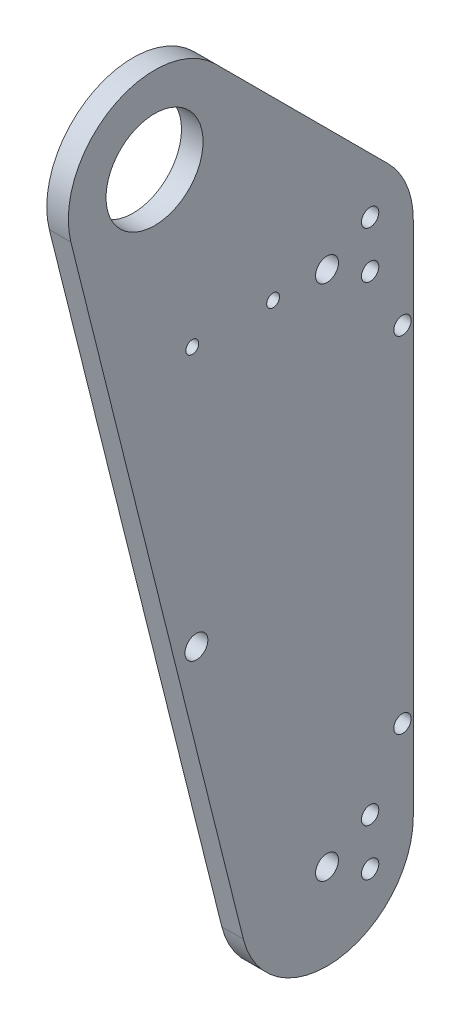
ISO-10303-21;
HEADER;
FILE_DESCRIPTION(('STEP AP214'),'2;1');
FILE_NAME('part.step','',(''),(''),'','','');
FILE_SCHEMA(('AUTOMOTIVE_DESIGN { 1 0 10303 214 1 1 1 1 }'));
ENDSEC;
DATA;
#1=APPLICATION_CONTEXT('core data for automotive mechanical design processes');
#2=APPLICATION_PROTOCOL_DEFINITION('international standard','automotive_design',2000,#1);
#3=PRODUCT_CONTEXT('',#1,'mechanical');
#4=PRODUCT('Part','Part','',(#3));
#5=PRODUCT_RELATED_PRODUCT_CATEGORY('part','',(#4));
#6=PRODUCT_DEFINITION_FORMATION('','',#4);
#7=PRODUCT_DEFINITION_CONTEXT('part definition',#1,'design');
#8=PRODUCT_DEFINITION('design','',#6,#7);
#9=PRODUCT_DEFINITION_SHAPE('','',#8);
#10=(LENGTH_UNIT() NAMED_UNIT(*) SI_UNIT(.MILLI.,.METRE.));
#11=(NAMED_UNIT(*) PLANE_ANGLE_UNIT() SI_UNIT($,.RADIAN.));
#12=(NAMED_UNIT(*) SI_UNIT($,.STERADIAN.) SOLID_ANGLE_UNIT());
#13=UNCERTAINTY_MEASURE_WITH_UNIT(LENGTH_MEASURE(1.E-05),#10,'distance_accuracy_value','');
#14=(GEOMETRIC_REPRESENTATION_CONTEXT(3) GLOBAL_UNCERTAINTY_ASSIGNED_CONTEXT((#13)) GLOBAL_UNIT_ASSIGNED_CONTEXT((#10,
#11,#12)) REPRESENTATION_CONTEXT('',''));
#15=CARTESIAN_POINT('',(0.,0.,0.));
#16=DIRECTION('',(0.,0.,1.));
#17=DIRECTION('',(1.,0.,0.));
#18=AXIS2_PLACEMENT_3D('',#15,#16,#17);
#19=CARTESIAN_POINT('',(6.35,0.,0.));
#20=DIRECTION('',(-1.,0.,0.));
#21=DIRECTION('',(0.,0.,1.));
#22=AXIS2_PLACEMENT_3D('',#19,#20,#21);
#23=CYLINDRICAL_SURFACE('',#22,25.4);
#24=CARTESIAN_POINT('',(0.,0.,0.));
#25=DIRECTION('',(1.,0.,0.));
#26=DIRECTION('',(0.,0.,-1.));
#27=AXIS2_PLACEMENT_3D('',#24,#25,#26);
#28=CIRCLE('',#27,25.4);
#29=CARTESIAN_POINT('',(0.,17.9605122421383,-17.9605122421383));
#30=VERTEX_POINT('',#29);
#31=CARTESIAN_POINT('',(0.,-6.16040487592286,24.6416195036914));
#32=VERTEX_POINT('',#31);
#33=EDGE_CURVE('E145',#30,#32,#28,.T.);
#34=ORIENTED_EDGE('',*,*,#33,.T.);
#35=DIRECTION('',(-1.,0.,0.));
#36=VECTOR('',#35,1.);
#37=CARTESIAN_POINT('',(6.35,-6.16040487592286,24.6416195036914));
#38=LINE('',#37,#36);
#39=CARTESIAN_POINT('',(6.35,-6.16040487592286,24.6416195036914));
#40=VERTEX_POINT('',#39);
#41=EDGE_CURVE('E11',#40,#32,#38,.T.);
#42=ORIENTED_EDGE('',*,*,#41,.F.);
#43=CARTESIAN_POINT('',(6.35,0.,0.));
#44=DIRECTION('',(1.,0.,0.));
#45=DIRECTION('',(0.,0.,-1.));
#46=AXIS2_PLACEMENT_3D('',#43,#44,#45);
#47=CIRCLE('',#46,25.4);
#48=CARTESIAN_POINT('',(6.35,17.9605122421383,-17.9605122421383));
#49=VERTEX_POINT('',#48);
#50=EDGE_CURVE('E162',#49,#40,#47,.T.);
#51=ORIENTED_EDGE('',*,*,#50,.F.);
#52=DIRECTION('',(-1.,0.,0.));
#53=VECTOR('',#52,1.);
#54=CARTESIAN_POINT('',(6.35,17.9605122421383,-17.9605122421383));
#55=LINE('',#54,#53);
#56=EDGE_CURVE('E141',#49,#30,#55,.T.);
#57=ORIENTED_EDGE('',*,*,#56,.T.);
#58=EDGE_LOOP('',(#34,#42,#51,#57));
#59=FACE_BOUND('',#58,.T.);
#60=ADVANCED_FACE('F43',(#59),#23,.T.);
#61=CARTESIAN_POINT('',(6.35,-6.16040487592286,24.6416195036914));
#62=DIRECTION('',(0.,0.242535625036333,-0.970142500145332));
#63=DIRECTION('',(0.,0.970142500145332,0.242535625036333));
#64=AXIS2_PLACEMENT_3D('',#61,#62,#63);
#65=PLANE('',#64);
#66=DIRECTION('',(0.,-0.970142500145332,-0.242535625036333));
#67=VECTOR('',#66,1.);
#68=CARTESIAN_POINT('',(0.,-6.16040487592286,24.6416195036914));
#69=LINE('',#68,#67);
#70=CARTESIAN_POINT('',(0.,-209.360404875923,-26.1583804963086));
#71=VERTEX_POINT('',#70);
#72=EDGE_CURVE('E149',#32,#71,#69,.T.);
#73=ORIENTED_EDGE('',*,*,#72,.T.);
#74=DIRECTION('',(-1.,0.,0.));
#75=VECTOR('',#74,1.);
#76=CARTESIAN_POINT('',(6.35,-209.360404875923,-26.1583804963086));
#77=LINE('',#76,#75);
#78=CARTESIAN_POINT('',(6.35,-209.360404875923,-26.1583804963086));
#79=VERTEX_POINT('',#78);
#80=EDGE_CURVE('E52',#79,#71,#77,.T.);
#81=ORIENTED_EDGE('',*,*,#80,.F.);
#82=DIRECTION('',(0.,-0.970142500145332,-0.242535625036333));
#83=VECTOR('',#82,1.);
#84=CARTESIAN_POINT('',(6.35,-6.16040487592286,24.6416195036914));
#85=LINE('',#84,#83);
#86=EDGE_CURVE('E106',#40,#79,#85,.T.);
#87=ORIENTED_EDGE('',*,*,#86,.F.);
#88=ORIENTED_EDGE('',*,*,#41,.T.);
#89=EDGE_LOOP('',(#73,#81,#87,#88));
#90=FACE_BOUND('',#89,.T.);
#91=ADVANCED_FACE('F191',(#90),#65,.F.);
#92=CARTESIAN_POINT('',(6.35,-203.2,-50.8));
#93=DIRECTION('',(-1.,0.,0.));
#94=DIRECTION('',(0.,0.,1.));
#95=AXIS2_PLACEMENT_3D('',#92,#93,#94);
#96=CYLINDRICAL_SURFACE('',#95,25.4);
#97=CARTESIAN_POINT('',(0.,-203.2,-50.8));
#98=DIRECTION('',(1.,0.,0.));
#99=DIRECTION('',(0.,0.,-1.));
#100=AXIS2_PLACEMENT_3D('',#97,#98,#99);
#101=CIRCLE('',#100,25.4);
#102=CARTESIAN_POINT('',(0.,-203.2,-76.2));
#103=VERTEX_POINT('',#102);
#104=EDGE_CURVE('E153',#71,#103,#101,.T.);
#105=ORIENTED_EDGE('',*,*,#104,.T.);
#106=DIRECTION('',(-1.,0.,0.));
#107=VECTOR('',#106,1.);
#108=CARTESIAN_POINT('',(6.35,-203.2,-76.2));
#109=LINE('',#108,#107);
#110=CARTESIAN_POINT('',(6.35,-203.2,-76.2));
#111=VERTEX_POINT('',#110);
#112=EDGE_CURVE('E133',#111,#103,#109,.T.);
#113=ORIENTED_EDGE('',*,*,#112,.F.);
#114=CARTESIAN_POINT('',(6.35,-203.2,-50.8));
#115=DIRECTION('',(1.,0.,0.));
#116=DIRECTION('',(0.,0.,-1.));
#117=AXIS2_PLACEMENT_3D('',#114,#115,#116);
#118=CIRCLE('',#117,25.4);
#119=EDGE_CURVE('E122',#79,#111,#118,.T.);
#120=ORIENTED_EDGE('',*,*,#119,.F.);
#121=ORIENTED_EDGE('',*,*,#80,.T.);
#122=EDGE_LOOP('',(#105,#113,#120,#121));
#123=FACE_BOUND('',#122,.T.);
#124=ADVANCED_FACE('F172',(#123),#96,.T.);
#125=CARTESIAN_POINT('',(6.35,-203.2,-76.2));
#126=DIRECTION('',(0.,0.,1.));
#127=DIRECTION('',(1.,0.,0.));
#128=AXIS2_PLACEMENT_3D('',#125,#126,#127);
#129=PLANE('',#128);
#130=DIRECTION('',(0.,1.,0.));
#131=VECTOR('',#130,1.);
#132=CARTESIAN_POINT('',(0.,-203.2,-76.2));
#133=LINE('',#132,#131);
#134=CARTESIAN_POINT('',(0.,-50.8,-76.2));
#135=VERTEX_POINT('',#134);
#136=EDGE_CURVE('E131',#103,#135,#133,.T.);
#137=ORIENTED_EDGE('',*,*,#136,.T.);
#138=DIRECTION('',(-1.,0.,0.));
#139=VECTOR('',#138,1.);
#140=CARTESIAN_POINT('',(6.35,-50.8,-76.2));
#141=LINE('',#140,#139);
#142=CARTESIAN_POINT('',(6.35,-50.8,-76.2));
#143=VERTEX_POINT('',#142);
#144=EDGE_CURVE('E128',#143,#135,#141,.T.);
#145=ORIENTED_EDGE('',*,*,#144,.F.);
#146=DIRECTION('',(0.,1.,0.));
#147=VECTOR('',#146,1.);
#148=CARTESIAN_POINT('',(6.35,-203.2,-76.2));
#149=LINE('',#148,#147);
#150=EDGE_CURVE('E116',#111,#143,#149,.T.);
#151=ORIENTED_EDGE('',*,*,#150,.F.);
#152=ORIENTED_EDGE('',*,*,#112,.T.);
#153=EDGE_LOOP('',(#137,#145,#151,#152));
#154=FACE_BOUND('',#153,.T.);
#155=ADVANCED_FACE('F129',(#154),#129,.F.);
#156=CARTESIAN_POINT('',(6.35,-50.8,-50.8));
#157=DIRECTION('',(-1.,0.,0.));
#158=DIRECTION('',(0.,0.,1.));
#159=AXIS2_PLACEMENT_3D('',#156,#157,#158);
#160=CYLINDRICAL_SURFACE('',#159,25.4);
#161=CARTESIAN_POINT('',(0.,-50.8,-50.8));
#162=DIRECTION('',(1.,0.,0.));
#163=DIRECTION('',(0.,0.,-1.));
#164=AXIS2_PLACEMENT_3D('',#161,#162,#163);
#165=CIRCLE('',#164,25.4);
#166=CARTESIAN_POINT('',(0.,-32.8394877578617,-68.7605122421383));
#167=VERTEX_POINT('',#166);
#168=EDGE_CURVE('E92',#135,#167,#165,.T.);
#169=ORIENTED_EDGE('',*,*,#168,.T.);
#170=DIRECTION('',(-1.,0.,0.));
#171=VECTOR('',#170,1.);
#172=CARTESIAN_POINT('',(6.35,-32.8394877578617,-68.7605122421383));
#173=LINE('',#172,#171);
#174=CARTESIAN_POINT('',(6.35,-32.8394877578617,-68.7605122421383));
#175=VERTEX_POINT('',#174);
#176=EDGE_CURVE('E134',#175,#167,#173,.T.);
#177=ORIENTED_EDGE('',*,*,#176,.F.);
#178=CARTESIAN_POINT('',(6.35,-50.8,-50.8));
#179=DIRECTION('',(1.,0.,0.));
#180=DIRECTION('',(0.,0.,-1.));
#181=AXIS2_PLACEMENT_3D('',#178,#179,#180);
#182=CIRCLE('',#181,25.4);
#183=EDGE_CURVE('E120',#143,#175,#182,.T.);
#184=ORIENTED_EDGE('',*,*,#183,.F.);
#185=ORIENTED_EDGE('',*,*,#144,.T.);
#186=EDGE_LOOP('',(#169,#177,#184,#185));
#187=FACE_BOUND('',#186,.T.);
#188=ADVANCED_FACE('F136',(#187),#160,.T.);
#189=CARTESIAN_POINT('',(6.35,-32.8394877578617,-68.7605122421383));
#190=DIRECTION('',(0.,-0.707106781186548,0.707106781186547));
#191=DIRECTION('',(0.,-0.707106781186547,-0.707106781186548));
#192=AXIS2_PLACEMENT_3D('',#189,#190,#191);
#193=PLANE('',#192);
#194=DIRECTION('',(0.,0.707106781186547,0.707106781186548));
#195=VECTOR('',#194,1.);
#196=CARTESIAN_POINT('',(0.,-32.8394877578617,-68.7605122421383));
#197=LINE('',#196,#195);
#198=EDGE_CURVE('E98',#167,#30,#197,.T.);
#199=ORIENTED_EDGE('',*,*,#198,.T.);
#200=ORIENTED_EDGE('',*,*,#56,.F.);
#201=DIRECTION('',(0.,0.707106781186547,0.707106781186548));
#202=VECTOR('',#201,1.);
#203=CARTESIAN_POINT('',(6.35,-32.8394877578617,-68.7605122421383));
#204=LINE('',#203,#202);
#205=EDGE_CURVE('E63',#175,#49,#204,.T.);
#206=ORIENTED_EDGE('',*,*,#205,.F.);
#207=ORIENTED_EDGE('',*,*,#176,.T.);
#208=EDGE_LOOP('',(#199,#200,#206,#207));
#209=FACE_BOUND('',#208,.T.);
#210=ADVANCED_FACE('F179',(#209),#193,.F.);
#211=CARTESIAN_POINT('',(6.35,0.,0.));
#212=DIRECTION('',(1.,0.,0.));
#213=DIRECTION('',(0.,0.,-1.));
#214=AXIS2_PLACEMENT_3D('',#211,#212,#213);
#215=PLANE('',#214);
#216=CARTESIAN_POINT('',(6.35,-76.2,-73.025));
#217=DIRECTION('',(-1.,0.,0.));
#218=DIRECTION('',(0.,0.,1.));
#219=AXIS2_PLACEMENT_3D('',#216,#217,#218);
#220=CIRCLE('',#219,2.55270000000001);
#221=CARTESIAN_POINT('',(6.35,-76.2,-70.4723));
#222=VERTEX_POINT('',#221);
#223=EDGE_CURVE('E366',#222,#222,#220,.T.);
#224=ORIENTED_EDGE('',*,*,#223,.T.);
#225=EDGE_LOOP('',(#224));
#226=FACE_BOUND('',#225,.T.);
#227=CARTESIAN_POINT('',(6.35,-177.8,-73.025));
#228=DIRECTION('',(-1.,0.,0.));
#229=DIRECTION('',(0.,0.,1.));
#230=AXIS2_PLACEMENT_3D('',#227,#228,#229);
#231=CIRCLE('',#230,2.55269999999999);
#232=CARTESIAN_POINT('',(6.35,-177.8,-70.4723));
#233=VERTEX_POINT('',#232);
#234=EDGE_CURVE('E379',#233,#233,#231,.T.);
#235=ORIENTED_EDGE('',*,*,#234,.T.);
#236=EDGE_LOOP('',(#235));
#237=FACE_BOUND('',#236,.T.);
#238=CARTESIAN_POINT('',(6.35,-50.8,-34.925));
#239=DIRECTION('',(-1.,0.,0.));
#240=DIRECTION('',(0.,0.,1.));
#241=AXIS2_PLACEMENT_3D('',#238,#239,#240);
#242=CIRCLE('',#241,1.89864999999999);
#243=CARTESIAN_POINT('',(6.35,-50.8,-33.02635));
#244=VERTEX_POINT('',#243);
#245=EDGE_CURVE('E387',#244,#244,#242,.T.);
#246=ORIENTED_EDGE('',*,*,#245,.T.);
#247=EDGE_LOOP('',(#246));
#248=FACE_BOUND('',#247,.T.);
#249=CARTESIAN_POINT('',(6.35,-50.8,-11.1125));
#250=DIRECTION('',(-1.,0.,0.));
#251=DIRECTION('',(0.,0.,1.));
#252=AXIS2_PLACEMENT_3D('',#249,#250,#251);
#253=CIRCLE('',#252,1.89864999999999);
#254=CARTESIAN_POINT('',(6.35,-50.8,-9.21385000000004));
#255=VERTEX_POINT('',#254);
#256=EDGE_CURVE('E395',#255,#255,#253,.T.);
#257=ORIENTED_EDGE('',*,*,#256,.T.);
#258=EDGE_LOOP('',(#257));
#259=FACE_BOUND('',#258,.T.);
#260=CARTESIAN_POINT('',(6.35,-57.7088,-63.5));
#261=DIRECTION('',(-1.,0.,0.));
#262=DIRECTION('',(0.,0.,1.));
#263=AXIS2_PLACEMENT_3D('',#260,#261,#262);
#264=CIRCLE('',#263,2.5527);
#265=CARTESIAN_POINT('',(6.35,-57.7088,-60.9473));
#266=VERTEX_POINT('',#265);
#267=EDGE_CURVE('E402',#266,#266,#264,.T.);
#268=ORIENTED_EDGE('',*,*,#267,.T.);
#269=EDGE_LOOP('',(#268));
#270=FACE_BOUND('',#269,.T.);
#271=CARTESIAN_POINT('',(6.35,-43.8912,-63.5));
#272=DIRECTION('',(-1.,0.,0.));
#273=DIRECTION('',(0.,0.,1.));
#274=AXIS2_PLACEMENT_3D('',#271,#272,#273);
#275=CIRCLE('',#274,2.5527);
#276=CARTESIAN_POINT('',(6.35,-43.8912,-60.9473));
#277=VERTEX_POINT('',#276);
#278=EDGE_CURVE('E410',#277,#277,#275,.T.);
#279=ORIENTED_EDGE('',*,*,#278,.T.);
#280=EDGE_LOOP('',(#279));
#281=FACE_BOUND('',#280,.T.);
#282=CARTESIAN_POINT('',(6.35,-196.2912,-63.5));
#283=DIRECTION('',(-1.,0.,0.));
#284=DIRECTION('',(0.,0.,1.));
#285=AXIS2_PLACEMENT_3D('',#282,#283,#284);
#286=CIRCLE('',#285,2.55269999999999);
#287=CARTESIAN_POINT('',(6.35,-196.2912,-60.9473));
#288=VERTEX_POINT('',#287);
#289=EDGE_CURVE('E418',#288,#288,#286,.T.);
#290=ORIENTED_EDGE('',*,*,#289,.T.);
#291=EDGE_LOOP('',(#290));
#292=FACE_BOUND('',#291,.T.);
#293=CARTESIAN_POINT('',(6.35,-210.1088,-63.5));
#294=DIRECTION('',(-1.,0.,0.));
#295=DIRECTION('',(0.,0.,1.));
#296=AXIS2_PLACEMENT_3D('',#293,#294,#295);
#297=CIRCLE('',#296,2.55269999999999);
#298=CARTESIAN_POINT('',(6.35,-210.1088,-60.9473));
#299=VERTEX_POINT('',#298);
#300=EDGE_CURVE('E426',#299,#299,#297,.T.);
#301=ORIENTED_EDGE('',*,*,#300,.T.);
#302=EDGE_LOOP('',(#301));
#303=FACE_BOUND('',#302,.T.);
#304=CARTESIAN_POINT('',(6.35,-50.8,-50.8));
#305=DIRECTION('',(1.,0.,0.));
#306=DIRECTION('',(0.,0.,-1.));
#307=AXIS2_PLACEMENT_3D('',#304,#305,#306);
#308=CIRCLE('',#307,3.37819999999998);
#309=CARTESIAN_POINT('',(6.35,-50.8,-54.1782));
#310=VERTEX_POINT('',#309);
#311=EDGE_CURVE('E430',#310,#310,#308,.T.);
#312=ORIENTED_EDGE('',*,*,#311,.F.);
#313=EDGE_LOOP('',(#312));
#314=FACE_BOUND('',#313,.T.);
#315=CARTESIAN_POINT('',(6.35,-203.2,-50.8));
#316=DIRECTION('',(1.,0.,0.));
#317=DIRECTION('',(0.,0.,-1.));
#318=AXIS2_PLACEMENT_3D('',#315,#316,#317);
#319=CIRCLE('',#318,3.3782);
#320=CARTESIAN_POINT('',(6.35,-203.2,-54.1782));
#321=VERTEX_POINT('',#320);
#322=EDGE_CURVE('E438',#321,#321,#319,.T.);
#323=ORIENTED_EDGE('',*,*,#322,.F.);
#324=EDGE_LOOP('',(#323));
#325=FACE_BOUND('',#324,.T.);
#326=CARTESIAN_POINT('',(6.35,-127.828401175399,-12.3208097518457));
#327=DIRECTION('',(1.,0.,0.));
#328=DIRECTION('',(0.,0.,-1.));
#329=AXIS2_PLACEMENT_3D('',#326,#327,#328);
#330=CIRCLE('',#329,3.37819999999998);
#331=CARTESIAN_POINT('',(6.35,-127.828401175399,-15.6990097518457));
#332=VERTEX_POINT('',#331);
#333=EDGE_CURVE('E446',#332,#332,#330,.T.);
#334=ORIENTED_EDGE('',*,*,#333,.F.);
#335=EDGE_LOOP('',(#334));
#336=FACE_BOUND('',#335,.T.);
#337=CARTESIAN_POINT('',(6.35,0.,0.));
#338=DIRECTION('',(1.,0.,0.));
#339=DIRECTION('',(0.,0.,-1.));
#340=AXIS2_PLACEMENT_3D('',#337,#338,#339);
#341=CIRCLE('',#340,14.2875);
#342=CARTESIAN_POINT('',(6.35,0.,-14.2875));
#343=VERTEX_POINT('',#342);
#344=EDGE_CURVE('E454',#343,#343,#341,.T.);
#345=ORIENTED_EDGE('',*,*,#344,.F.);
#346=EDGE_LOOP('',(#345));
#347=FACE_BOUND('',#346,.T.);
#348=ORIENTED_EDGE('',*,*,#50,.T.);
#349=ORIENTED_EDGE('',*,*,#86,.T.);
#350=ORIENTED_EDGE('',*,*,#119,.T.);
#351=ORIENTED_EDGE('',*,*,#150,.T.);
#352=ORIENTED_EDGE('',*,*,#183,.T.);
#353=ORIENTED_EDGE('',*,*,#205,.T.);
#354=EDGE_LOOP('',(#348,#349,#350,#351,#352,#353));
#355=FACE_BOUND('',#354,.T.);
#356=ADVANCED_FACE('F118',(#226,#237,#248,#259,#270,#281,#292,#303,#314,#325,#336,#347,#355),
#215,.T.);
#357=CARTESIAN_POINT('',(0.,0.,0.));
#358=DIRECTION('',(1.,0.,0.));
#359=DIRECTION('',(0.,0.,-1.));
#360=AXIS2_PLACEMENT_3D('',#357,#358,#359);
#361=PLANE('',#360);
#362=CARTESIAN_POINT('',(0.,-76.2,-73.025));
#363=DIRECTION('',(-1.,0.,0.));
#364=DIRECTION('',(0.,0.,1.));
#365=AXIS2_PLACEMENT_3D('',#362,#363,#364);
#366=CIRCLE('',#365,2.55270000000001);
#367=CARTESIAN_POINT('',(0.,-76.2,-70.4723));
#368=VERTEX_POINT('',#367);
#369=EDGE_CURVE('E369',#368,#368,#366,.T.);
#370=ORIENTED_EDGE('',*,*,#369,.F.);
#371=EDGE_LOOP('',(#370));
#372=FACE_BOUND('',#371,.T.);
#373=CARTESIAN_POINT('',(0.,-177.8,-73.025));
#374=DIRECTION('',(-1.,0.,0.));
#375=DIRECTION('',(0.,0.,1.));
#376=AXIS2_PLACEMENT_3D('',#373,#374,#375);
#377=CIRCLE('',#376,2.55269999999999);
#378=CARTESIAN_POINT('',(0.,-177.8,-70.4723));
#379=VERTEX_POINT('',#378);
#380=EDGE_CURVE('E373',#379,#379,#377,.T.);
#381=ORIENTED_EDGE('',*,*,#380,.F.);
#382=EDGE_LOOP('',(#381));
#383=FACE_BOUND('',#382,.T.);
#384=CARTESIAN_POINT('',(0.,-50.8,-34.925));
#385=DIRECTION('',(-1.,0.,0.));
#386=DIRECTION('',(0.,0.,1.));
#387=AXIS2_PLACEMENT_3D('',#384,#385,#386);
#388=CIRCLE('',#387,1.89864999999999);
#389=CARTESIAN_POINT('',(0.,-50.8,-33.02635));
#390=VERTEX_POINT('',#389);
#391=EDGE_CURVE('E383',#390,#390,#388,.T.);
#392=ORIENTED_EDGE('',*,*,#391,.F.);
#393=EDGE_LOOP('',(#392));
#394=FACE_BOUND('',#393,.T.);
#395=CARTESIAN_POINT('',(0.,-50.8,-11.1125));
#396=DIRECTION('',(-1.,0.,0.));
#397=DIRECTION('',(0.,0.,1.));
#398=AXIS2_PLACEMENT_3D('',#395,#396,#397);
#399=CIRCLE('',#398,1.89864999999999);
#400=CARTESIAN_POINT('',(0.,-50.8,-9.21385000000003));
#401=VERTEX_POINT('',#400);
#402=EDGE_CURVE('E391',#401,#401,#399,.T.);
#403=ORIENTED_EDGE('',*,*,#402,.F.);
#404=EDGE_LOOP('',(#403));
#405=FACE_BOUND('',#404,.T.);
#406=CARTESIAN_POINT('',(0.,-57.7088,-63.5));
#407=DIRECTION('',(-1.,0.,0.));
#408=DIRECTION('',(0.,0.,1.));
#409=AXIS2_PLACEMENT_3D('',#406,#407,#408);
#410=CIRCLE('',#409,2.5527);
#411=CARTESIAN_POINT('',(0.,-57.7088,-60.9473));
#412=VERTEX_POINT('',#411);
#413=EDGE_CURVE('E399',#412,#412,#410,.T.);
#414=ORIENTED_EDGE('',*,*,#413,.F.);
#415=EDGE_LOOP('',(#414));
#416=FACE_BOUND('',#415,.T.);
#417=CARTESIAN_POINT('',(0.,-43.8912,-63.5));
#418=DIRECTION('',(-1.,0.,0.));
#419=DIRECTION('',(0.,0.,1.));
#420=AXIS2_PLACEMENT_3D('',#417,#418,#419);
#421=CIRCLE('',#420,2.5527);
#422=CARTESIAN_POINT('',(0.,-43.8912,-60.9473));
#423=VERTEX_POINT('',#422);
#424=EDGE_CURVE('E406',#423,#423,#421,.T.);
#425=ORIENTED_EDGE('',*,*,#424,.F.);
#426=EDGE_LOOP('',(#425));
#427=FACE_BOUND('',#426,.T.);
#428=CARTESIAN_POINT('',(0.,-196.2912,-63.5));
#429=DIRECTION('',(-1.,0.,0.));
#430=DIRECTION('',(0.,0.,1.));
#431=AXIS2_PLACEMENT_3D('',#428,#429,#430);
#432=CIRCLE('',#431,2.55269999999999);
#433=CARTESIAN_POINT('',(0.,-196.2912,-60.9473));
#434=VERTEX_POINT('',#433);
#435=EDGE_CURVE('E414',#434,#434,#432,.T.);
#436=ORIENTED_EDGE('',*,*,#435,.F.);
#437=EDGE_LOOP('',(#436));
#438=FACE_BOUND('',#437,.T.);
#439=CARTESIAN_POINT('',(0.,-210.1088,-63.5));
#440=DIRECTION('',(-1.,0.,0.));
#441=DIRECTION('',(0.,0.,1.));
#442=AXIS2_PLACEMENT_3D('',#439,#440,#441);
#443=CIRCLE('',#442,2.55269999999999);
#444=CARTESIAN_POINT('',(0.,-210.1088,-60.9473));
#445=VERTEX_POINT('',#444);
#446=EDGE_CURVE('E422',#445,#445,#443,.T.);
#447=ORIENTED_EDGE('',*,*,#446,.F.);
#448=EDGE_LOOP('',(#447));
#449=FACE_BOUND('',#448,.T.);
#450=CARTESIAN_POINT('',(0.,-50.8,-50.8));
#451=DIRECTION('',(1.,0.,0.));
#452=DIRECTION('',(0.,0.,-1.));
#453=AXIS2_PLACEMENT_3D('',#450,#451,#452);
#454=CIRCLE('',#453,3.3782);
#455=CARTESIAN_POINT('',(0.,-50.8,-54.1782));
#456=VERTEX_POINT('',#455);
#457=EDGE_CURVE('E434',#456,#456,#454,.T.);
#458=ORIENTED_EDGE('',*,*,#457,.T.);
#459=EDGE_LOOP('',(#458));
#460=FACE_BOUND('',#459,.T.);
#461=CARTESIAN_POINT('',(0.,-203.2,-50.8));
#462=DIRECTION('',(1.,0.,0.));
#463=DIRECTION('',(0.,0.,-1.));
#464=AXIS2_PLACEMENT_3D('',#461,#462,#463);
#465=CIRCLE('',#464,3.3782);
#466=CARTESIAN_POINT('',(0.,-203.2,-54.1782));
#467=VERTEX_POINT('',#466);
#468=EDGE_CURVE('E442',#467,#467,#465,.T.);
#469=ORIENTED_EDGE('',*,*,#468,.T.);
#470=EDGE_LOOP('',(#469));
#471=FACE_BOUND('',#470,.T.);
#472=CARTESIAN_POINT('',(0.,-127.828401175399,-12.3208097518457));
#473=DIRECTION('',(1.,0.,0.));
#474=DIRECTION('',(0.,0.,-1.));
#475=AXIS2_PLACEMENT_3D('',#472,#473,#474);
#476=CIRCLE('',#475,3.3782);
#477=CARTESIAN_POINT('',(0.,-127.828401175399,-15.6990097518457));
#478=VERTEX_POINT('',#477);
#479=EDGE_CURVE('E450',#478,#478,#476,.T.);
#480=ORIENTED_EDGE('',*,*,#479,.T.);
#481=EDGE_LOOP('',(#480));
#482=FACE_BOUND('',#481,.T.);
#483=CARTESIAN_POINT('',(0.,0.,0.));
#484=DIRECTION('',(1.,0.,0.));
#485=DIRECTION('',(0.,0.,-1.));
#486=AXIS2_PLACEMENT_3D('',#483,#484,#485);
#487=CIRCLE('',#486,14.2875);
#488=CARTESIAN_POINT('',(0.,0.,-14.2875));
#489=VERTEX_POINT('',#488);
#490=EDGE_CURVE('E150',#489,#489,#487,.T.);
#491=ORIENTED_EDGE('',*,*,#490,.T.);
#492=EDGE_LOOP('',(#491));
#493=FACE_BOUND('',#492,.T.);
#494=ORIENTED_EDGE('',*,*,#33,.F.);
#495=ORIENTED_EDGE('',*,*,#198,.F.);
#496=ORIENTED_EDGE('',*,*,#168,.F.);
#497=ORIENTED_EDGE('',*,*,#136,.F.);
#498=ORIENTED_EDGE('',*,*,#104,.F.);
#499=ORIENTED_EDGE('',*,*,#72,.F.);
#500=EDGE_LOOP('',(#494,#495,#496,#497,#498,#499));
#501=FACE_BOUND('',#500,.T.);
#502=ADVANCED_FACE('F175',(#372,#383,#394,#405,#416,#427,#438,#449,#460,#471,#482,#493,#501),
#361,.F.);
#503=CARTESIAN_POINT('',(6.35,0.,0.));
#504=DIRECTION('',(1.,0.,0.));
#505=DIRECTION('',(0.,0.,-1.));
#506=AXIS2_PLACEMENT_3D('',#503,#504,#505);
#507=CYLINDRICAL_SURFACE('',#506,14.2875);
#508=ORIENTED_EDGE('',*,*,#490,.F.);
#509=EDGE_LOOP('',(#508));
#510=FACE_BOUND('',#509,.T.);
#511=ORIENTED_EDGE('',*,*,#344,.T.);
#512=EDGE_LOOP('',(#511));
#513=FACE_BOUND('',#512,.T.);
#514=ADVANCED_FACE('F224',(#510,#513),#507,.F.);
#515=CARTESIAN_POINT('',(6.35,-127.828401175399,-12.3208097518457));
#516=DIRECTION('',(1.,0.,0.));
#517=DIRECTION('',(0.,0.,-1.));
#518=AXIS2_PLACEMENT_3D('',#515,#516,#517);
#519=CYLINDRICAL_SURFACE('',#518,3.37819999999999);
#520=ORIENTED_EDGE('',*,*,#479,.F.);
#521=EDGE_LOOP('',(#520));
#522=FACE_BOUND('',#521,.T.);
#523=ORIENTED_EDGE('',*,*,#333,.T.);
#524=EDGE_LOOP('',(#523));
#525=FACE_BOUND('',#524,.T.);
#526=ADVANCED_FACE('F230',(#522,#525),#519,.F.);
#527=CARTESIAN_POINT('',(6.35,-203.2,-50.8));
#528=DIRECTION('',(1.,0.,0.));
#529=DIRECTION('',(0.,0.,-1.));
#530=AXIS2_PLACEMENT_3D('',#527,#528,#529);
#531=CYLINDRICAL_SURFACE('',#530,3.3782);
#532=ORIENTED_EDGE('',*,*,#468,.F.);
#533=EDGE_LOOP('',(#532));
#534=FACE_BOUND('',#533,.T.);
#535=ORIENTED_EDGE('',*,*,#322,.T.);
#536=EDGE_LOOP('',(#535));
#537=FACE_BOUND('',#536,.T.);
#538=ADVANCED_FACE('F242',(#534,#537),#531,.F.);
#539=CARTESIAN_POINT('',(6.35,-50.8,-50.8));
#540=DIRECTION('',(1.,0.,0.));
#541=DIRECTION('',(0.,0.,-1.));
#542=AXIS2_PLACEMENT_3D('',#539,#540,#541);
#543=CYLINDRICAL_SURFACE('',#542,3.37819999999999);
#544=ORIENTED_EDGE('',*,*,#457,.F.);
#545=EDGE_LOOP('',(#544));
#546=FACE_BOUND('',#545,.T.);
#547=ORIENTED_EDGE('',*,*,#311,.T.);
#548=EDGE_LOOP('',(#547));
#549=FACE_BOUND('',#548,.T.);
#550=ADVANCED_FACE('F252',(#546,#549),#543,.F.);
#551=CARTESIAN_POINT('',(0.,-210.1088,-63.5));
#552=DIRECTION('',(-1.,0.,0.));
#553=DIRECTION('',(0.,0.,1.));
#554=AXIS2_PLACEMENT_3D('',#551,#552,#553);
#555=CYLINDRICAL_SURFACE('',#554,2.55269999999999);
#556=ORIENTED_EDGE('',*,*,#300,.F.);
#557=EDGE_LOOP('',(#556));
#558=FACE_BOUND('',#557,.T.);
#559=ORIENTED_EDGE('',*,*,#446,.T.);
#560=EDGE_LOOP('',(#559));
#561=FACE_BOUND('',#560,.T.);
#562=ADVANCED_FACE('F261',(#558,#561),#555,.F.);
#563=CARTESIAN_POINT('',(0.,-196.2912,-63.5));
#564=DIRECTION('',(-1.,0.,0.));
#565=DIRECTION('',(0.,0.,1.));
#566=AXIS2_PLACEMENT_3D('',#563,#564,#565);
#567=CYLINDRICAL_SURFACE('',#566,2.55269999999999);
#568=ORIENTED_EDGE('',*,*,#289,.F.);
#569=EDGE_LOOP('',(#568));
#570=FACE_BOUND('',#569,.T.);
#571=ORIENTED_EDGE('',*,*,#435,.T.);
#572=EDGE_LOOP('',(#571));
#573=FACE_BOUND('',#572,.T.);
#574=ADVANCED_FACE('F271',(#570,#573),#567,.F.);
#575=CARTESIAN_POINT('',(0.,-43.8912,-63.5));
#576=DIRECTION('',(-1.,0.,0.));
#577=DIRECTION('',(0.,0.,1.));
#578=AXIS2_PLACEMENT_3D('',#575,#576,#577);
#579=CYLINDRICAL_SURFACE('',#578,2.5527);
#580=ORIENTED_EDGE('',*,*,#278,.F.);
#581=EDGE_LOOP('',(#580));
#582=FACE_BOUND('',#581,.T.);
#583=ORIENTED_EDGE('',*,*,#424,.T.);
#584=EDGE_LOOP('',(#583));
#585=FACE_BOUND('',#584,.T.);
#586=ADVANCED_FACE('F283',(#582,#585),#579,.F.);
#587=CARTESIAN_POINT('',(0.,-57.7088,-63.5));
#588=DIRECTION('',(-1.,0.,0.));
#589=DIRECTION('',(0.,0.,1.));
#590=AXIS2_PLACEMENT_3D('',#587,#588,#589);
#591=CYLINDRICAL_SURFACE('',#590,2.5527);
#592=ORIENTED_EDGE('',*,*,#267,.F.);
#593=EDGE_LOOP('',(#592));
#594=FACE_BOUND('',#593,.T.);
#595=ORIENTED_EDGE('',*,*,#413,.T.);
#596=EDGE_LOOP('',(#595));
#597=FACE_BOUND('',#596,.T.);
#598=ADVANCED_FACE('F294',(#594,#597),#591,.F.);
#599=CARTESIAN_POINT('',(0.,-50.8,-11.1125));
#600=DIRECTION('',(-1.,0.,0.));
#601=DIRECTION('',(0.,0.,1.));
#602=AXIS2_PLACEMENT_3D('',#599,#600,#601);
#603=CYLINDRICAL_SURFACE('',#602,1.89864999999999);
#604=ORIENTED_EDGE('',*,*,#256,.F.);
#605=EDGE_LOOP('',(#604));
#606=FACE_BOUND('',#605,.T.);
#607=ORIENTED_EDGE('',*,*,#402,.T.);
#608=EDGE_LOOP('',(#607));
#609=FACE_BOUND('',#608,.T.);
#610=ADVANCED_FACE('F305',(#606,#609),#603,.F.);
#611=CARTESIAN_POINT('',(0.,-50.8,-34.925));
#612=DIRECTION('',(-1.,0.,0.));
#613=DIRECTION('',(0.,0.,1.));
#614=AXIS2_PLACEMENT_3D('',#611,#612,#613);
#615=CYLINDRICAL_SURFACE('',#614,1.89864999999999);
#616=ORIENTED_EDGE('',*,*,#245,.F.);
#617=EDGE_LOOP('',(#616));
#618=FACE_BOUND('',#617,.T.);
#619=ORIENTED_EDGE('',*,*,#391,.T.);
#620=EDGE_LOOP('',(#619));
#621=FACE_BOUND('',#620,.T.);
#622=ADVANCED_FACE('F317',(#618,#621),#615,.F.);
#623=CARTESIAN_POINT('',(0.,-177.8,-73.025));
#624=DIRECTION('',(-1.,0.,0.));
#625=DIRECTION('',(0.,0.,1.));
#626=AXIS2_PLACEMENT_3D('',#623,#624,#625);
#627=CYLINDRICAL_SURFACE('',#626,2.55269999999999);
#628=ORIENTED_EDGE('',*,*,#234,.F.);
#629=EDGE_LOOP('',(#628));
#630=FACE_BOUND('',#629,.T.);
#631=ORIENTED_EDGE('',*,*,#380,.T.);
#632=EDGE_LOOP('',(#631));
#633=FACE_BOUND('',#632,.T.);
#634=ADVANCED_FACE('F327',(#630,#633),#627,.F.);
#635=CARTESIAN_POINT('',(0.,-76.2,-73.025));
#636=DIRECTION('',(-1.,0.,0.));
#637=DIRECTION('',(0.,0.,1.));
#638=AXIS2_PLACEMENT_3D('',#635,#636,#637);
#639=CYLINDRICAL_SURFACE('',#638,2.55270000000001);
#640=ORIENTED_EDGE('',*,*,#223,.F.);
#641=EDGE_LOOP('',(#640));
#642=FACE_BOUND('',#641,.T.);
#643=ORIENTED_EDGE('',*,*,#369,.T.);
#644=EDGE_LOOP('',(#643));
#645=FACE_BOUND('',#644,.T.);
#646=ADVANCED_FACE('F349',(#642,#645),#639,.F.);
#647=CLOSED_SHELL('',(#60,#91,#124,#155,#188,#210,#356,#502,#514,#526,#538,#550,#562,#574,#586,
#598,#610,#622,#634,#646));
#648=MANIFOLD_SOLID_BREP('B2',#647);
#649=ADVANCED_BREP_SHAPE_REPRESENTATION('',(#18,#648),#14);
#650=SHAPE_DEFINITION_REPRESENTATION(#9,#649);
ENDSEC;
END-ISO-10303-21;
